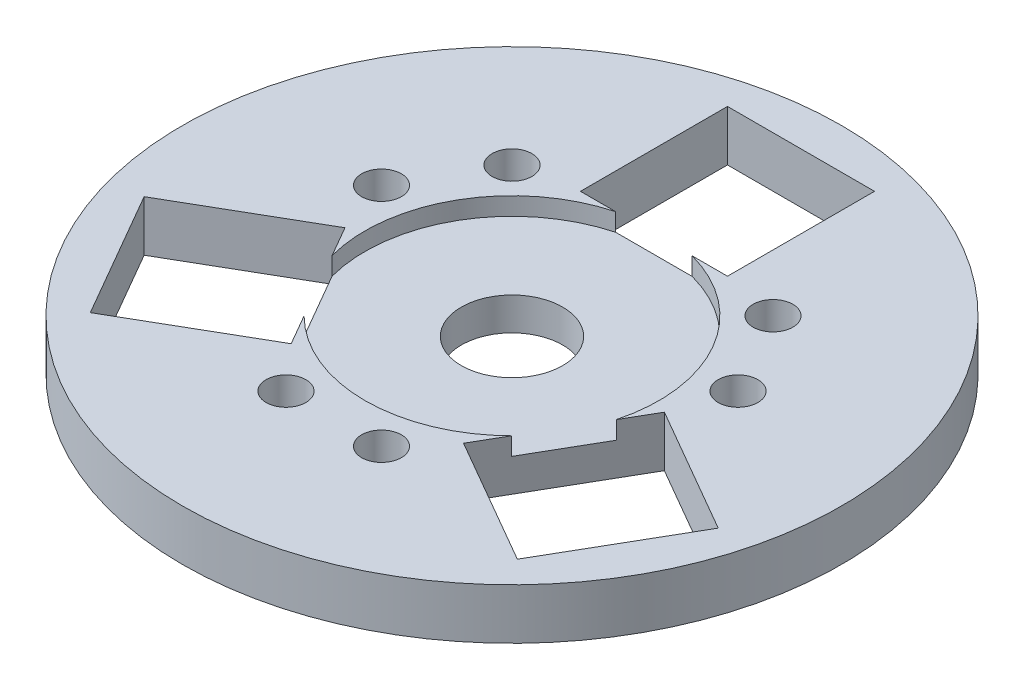
ISO-10303-21;
HEADER;
FILE_DESCRIPTION(('STEP AP214'),'2;1');
FILE_NAME('part.step','',(''),(''),'','','');
FILE_SCHEMA(('AUTOMOTIVE_DESIGN { 1 0 10303 214 1 1 1 1 }'));
ENDSEC;
DATA;
#1=APPLICATION_CONTEXT('core data for automotive mechanical design processes');
#2=APPLICATION_PROTOCOL_DEFINITION('international standard','automotive_design',2000,#1);
#3=PRODUCT_CONTEXT('',#1,'mechanical');
#4=PRODUCT('Part','Part','',(#3));
#5=PRODUCT_RELATED_PRODUCT_CATEGORY('part','',(#4));
#6=PRODUCT_DEFINITION_FORMATION('','',#4);
#7=PRODUCT_DEFINITION_CONTEXT('part definition',#1,'design');
#8=PRODUCT_DEFINITION('design','',#6,#7);
#9=PRODUCT_DEFINITION_SHAPE('','',#8);
#10=(LENGTH_UNIT() NAMED_UNIT(*) SI_UNIT(.MILLI.,.METRE.));
#11=(NAMED_UNIT(*) PLANE_ANGLE_UNIT() SI_UNIT($,.RADIAN.));
#12=(NAMED_UNIT(*) SI_UNIT($,.STERADIAN.) SOLID_ANGLE_UNIT());
#13=UNCERTAINTY_MEASURE_WITH_UNIT(LENGTH_MEASURE(1.E-05),#10,'distance_accuracy_value','');
#14=(GEOMETRIC_REPRESENTATION_CONTEXT(3) GLOBAL_UNCERTAINTY_ASSIGNED_CONTEXT((#13)) GLOBAL_UNIT_ASSIGNED_CONTEXT((#10,
#11,#12)) REPRESENTATION_CONTEXT('',''));
#15=CARTESIAN_POINT('',(0.,0.,0.));
#16=DIRECTION('',(0.,0.,1.));
#17=DIRECTION('',(1.,0.,0.));
#18=AXIS2_PLACEMENT_3D('',#15,#16,#17);
#19=CARTESIAN_POINT('',(0.,3.175,0.));
#20=DIRECTION('',(0.,-1.,0.));
#21=DIRECTION('',(0.,0.,-1.));
#22=AXIS2_PLACEMENT_3D('',#19,#20,#21);
#23=CYLINDRICAL_SURFACE('',#22,6.35);
#24=CARTESIAN_POINT('',(0.,-3.175,0.));
#25=DIRECTION('',(0.,1.,0.));
#26=DIRECTION('',(0.,0.,1.));
#27=AXIS2_PLACEMENT_3D('',#24,#25,#26);
#28=CIRCLE('',#27,6.35);
#29=CARTESIAN_POINT('',(0.,-3.175,6.35));
#30=VERTEX_POINT('',#29);
#31=EDGE_CURVE('E294',#30,#30,#28,.T.);
#32=ORIENTED_EDGE('',*,*,#31,.F.);
#33=EDGE_LOOP('',(#32));
#34=FACE_BOUND('',#33,.T.);
#35=CARTESIAN_POINT('',(0.,0.9398,0.));
#36=DIRECTION('',(0.,1.,0.));
#37=DIRECTION('',(0.,0.,1.));
#38=AXIS2_PLACEMENT_3D('',#35,#36,#37);
#39=CIRCLE('',#38,6.35);
#40=CARTESIAN_POINT('',(0.,0.9398,6.35));
#41=VERTEX_POINT('',#40);
#42=EDGE_CURVE('E185',#41,#41,#39,.T.);
#43=ORIENTED_EDGE('',*,*,#42,.T.);
#44=EDGE_LOOP('',(#43));
#45=FACE_BOUND('',#44,.T.);
#46=ADVANCED_FACE('F38',(#34,#45),#23,.F.);
#47=CARTESIAN_POINT('',(0.,3.175,0.));
#48=DIRECTION('',(0.,1.,0.));
#49=DIRECTION('',(0.,0.,1.));
#50=AXIS2_PLACEMENT_3D('',#47,#48,#49);
#51=PLANE('',#50);
#52=CARTESIAN_POINT('',(22.3264095488456,3.175,-5.98234340849944));
#53=DIRECTION('',(0.,1.,0.));
#54=DIRECTION('',(-0.866025403784436,0.,-0.500000000000004));
#55=AXIS2_PLACEMENT_3D('',#52,#53,#54);
#56=CIRCLE('',#55,2.4892);
#57=CARTESIAN_POINT('',(20.1706991137454,3.175,-7.22694340849945));
#58=VERTEX_POINT('',#57);
#59=EDGE_CURVE('E343',#58,#58,#56,.T.);
#60=ORIENTED_EDGE('',*,*,#59,.F.);
#61=EDGE_LOOP('',(#60));
#62=FACE_BOUND('',#61,.T.);
#63=CARTESIAN_POINT('',(5.98234340849958,3.175,22.3264095488455));
#64=DIRECTION('',(0.,1.,0.));
#65=DIRECTION('',(0.866025403784443,0.,-0.499999999999992));
#66=AXIS2_PLACEMENT_3D('',#63,#64,#65);
#67=CIRCLE('',#66,2.4892);
#68=CARTESIAN_POINT('',(8.13805384359982,3.175,21.0818095488456));
#69=VERTEX_POINT('',#68);
#70=EDGE_CURVE('E354',#69,#69,#67,.T.);
#71=ORIENTED_EDGE('',*,*,#70,.F.);
#72=EDGE_LOOP('',(#71));
#73=FACE_BOUND('',#72,.T.);
#74=CARTESIAN_POINT('',(-5.98234340849999,3.175,22.3264095488454));
#75=DIRECTION('',(0.,1.,0.));
#76=DIRECTION('',(0.866025403784443,0.,-0.499999999999992));
#77=AXIS2_PLACEMENT_3D('',#74,#75,#76);
#78=CIRCLE('',#77,2.4892);
#79=CARTESIAN_POINT('',(-3.82663297339976,3.175,21.0818095488455));
#80=VERTEX_POINT('',#79);
#81=EDGE_CURVE('E333',#80,#80,#78,.T.);
#82=ORIENTED_EDGE('',*,*,#81,.F.);
#83=EDGE_LOOP('',(#82));
#84=FACE_BOUND('',#83,.T.);
#85=CARTESIAN_POINT('',(16.3440661403458,3.175,-16.3440661403459));
#86=DIRECTION('',(0.,1.,0.));
#87=DIRECTION('',(-0.866025403784436,0.,-0.500000000000004));
#88=AXIS2_PLACEMENT_3D('',#85,#86,#87);
#89=CIRCLE('',#88,2.4892);
#90=CARTESIAN_POINT('',(14.1883557052456,3.175,-17.5886661403459));
#91=VERTEX_POINT('',#90);
#92=EDGE_CURVE('E359',#91,#91,#89,.T.);
#93=ORIENTED_EDGE('',*,*,#92,.F.);
#94=EDGE_LOOP('',(#93));
#95=FACE_BOUND('',#94,.T.);
#96=CARTESIAN_POINT('',(-16.3440661403458,3.175,-16.3440661403459));
#97=DIRECTION('',(0.,1.,0.));
#98=DIRECTION('',(0.,0.,1.));
#99=AXIS2_PLACEMENT_3D('',#96,#97,#98);
#100=CIRCLE('',#99,2.4892);
#101=CARTESIAN_POINT('',(-16.3440661403458,3.175,-13.8548661403459));
#102=VERTEX_POINT('',#101);
#103=EDGE_CURVE('E325',#102,#102,#100,.T.);
#104=ORIENTED_EDGE('',*,*,#103,.F.);
#105=EDGE_LOOP('',(#104));
#106=FACE_BOUND('',#105,.T.);
#107=CARTESIAN_POINT('',(-22.3264095488456,3.175,-5.98234340849954));
#108=DIRECTION('',(0.,1.,0.));
#109=DIRECTION('',(0.,0.,1.));
#110=AXIS2_PLACEMENT_3D('',#107,#108,#109);
#111=CIRCLE('',#110,2.4892);
#112=CARTESIAN_POINT('',(-22.3264095488456,3.175,-3.49314340849954));
#113=VERTEX_POINT('',#112);
#114=EDGE_CURVE('E337',#113,#113,#111,.T.);
#115=ORIENTED_EDGE('',*,*,#114,.F.);
#116=EDGE_LOOP('',(#115));
#117=FACE_BOUND('',#116,.T.);
#118=CARTESIAN_POINT('',(0.,3.175,0.));
#119=DIRECTION('',(0.,1.,0.));
#120=DIRECTION('',(0.,0.,1.));
#121=AXIS2_PLACEMENT_3D('',#118,#119,#120);
#122=CIRCLE('',#121,18.415);
#123=CARTESIAN_POINT('',(17.7950041124858,3.175,4.7381487562776));
#124=VERTEX_POINT('',#123);
#125=CARTESIAN_POINT('',(4.79414486639694,3.175,-17.78));
#126=VERTEX_POINT('',#125);
#127=EDGE_CURVE('E177',#124,#126,#122,.T.);
#128=ORIENTED_EDGE('',*,*,#127,.F.);
#129=DIRECTION('',(-0.500000000000004,0.,0.866025403784436));
#130=VECTOR('',#129,1.);
#131=CARTESIAN_POINT('',(20.0016816792873,3.175,0.916071094654875));
#132=LINE('',#131,#130);
#133=CARTESIAN_POINT('',(20.0016816792873,3.175,0.916071094654875));
#134=VERTEX_POINT('',#133);
#135=EDGE_CURVE('E222',#134,#124,#132,.T.);
#136=ORIENTED_EDGE('',*,*,#135,.F.);
#137=DIRECTION('',(-0.866025403784436,0.,-0.500000000000004));
#138=VECTOR('',#137,1.);
#139=CARTESIAN_POINT('',(35.9495394899777,3.175,10.1235710946549));
#140=LINE('',#139,#138);
#141=CARTESIAN_POINT('',(35.9495394899777,3.175,10.1235710946549));
#142=VERTEX_POINT('',#141);
#143=EDGE_CURVE('E61',#142,#134,#140,.T.);
#144=ORIENTED_EDGE('',*,*,#143,.F.);
#145=DIRECTION('',(0.500000000000004,0.,-0.866025403784436));
#146=VECTOR('',#145,1.);
#147=CARTESIAN_POINT('',(35.9495394899777,3.175,10.1235710946549));
#148=LINE('',#147,#146);
#149=CARTESIAN_POINT('',(26.7420394899776,3.175,26.0714289053453));
#150=VERTEX_POINT('',#149);
#151=EDGE_CURVE('E209',#150,#142,#148,.T.);
#152=ORIENTED_EDGE('',*,*,#151,.F.);
#153=DIRECTION('',(0.866025403784436,0.,0.500000000000004));
#154=VECTOR('',#153,1.);
#155=CARTESIAN_POINT('',(26.7420394899776,3.175,26.0714289053453));
#156=LINE('',#155,#154);
#157=CARTESIAN_POINT('',(10.7941816792872,3.175,16.8639289053453));
#158=VERTEX_POINT('',#157);
#159=EDGE_CURVE('E225',#158,#150,#156,.T.);
#160=ORIENTED_EDGE('',*,*,#159,.F.);
#161=CARTESIAN_POINT('',(13.0008592460888,3.175,13.0418512437225));
#162=VERTEX_POINT('',#161);
#163=EDGE_CURVE('E220',#162,#158,#132,.T.);
#164=ORIENTED_EDGE('',*,*,#163,.F.);
#165=CARTESIAN_POINT('',(-13.000859246089,3.175,13.0418512437224));
#166=VERTEX_POINT('',#165);
#167=EDGE_CURVE('E321',#166,#162,#122,.T.);
#168=ORIENTED_EDGE('',*,*,#167,.F.);
#169=DIRECTION('',(-0.499999999999992,0.,-0.866025403784443));
#170=VECTOR('',#169,1.);
#171=CARTESIAN_POINT('',(-10.7941816792875,3.175,16.8639289053451));
#172=LINE('',#171,#170);
#173=CARTESIAN_POINT('',(-10.7941816792875,3.175,16.8639289053451));
#174=VERTEX_POINT('',#173);
#175=EDGE_CURVE('E183',#174,#166,#172,.T.);
#176=ORIENTED_EDGE('',*,*,#175,.F.);
#177=DIRECTION('',(0.866025403784443,0.,-0.499999999999992));
#178=VECTOR('',#177,1.);
#179=CARTESIAN_POINT('',(-26.742039489978,3.175,26.071428905345));
#180=LINE('',#179,#178);
#181=CARTESIAN_POINT('',(-26.742039489978,3.175,26.071428905345));
#182=VERTEX_POINT('',#181);
#183=EDGE_CURVE('E202',#182,#174,#180,.T.);
#184=ORIENTED_EDGE('',*,*,#183,.F.);
#185=DIRECTION('',(0.499999999999992,0.,0.866025403784443));
#186=VECTOR('',#185,1.);
#187=CARTESIAN_POINT('',(-26.742039489978,3.175,26.071428905345));
#188=LINE('',#187,#186);
#189=CARTESIAN_POINT('',(-35.9495394899778,3.175,10.1235710946544));
#190=VERTEX_POINT('',#189);
#191=EDGE_CURVE('E243',#190,#182,#188,.T.);
#192=ORIENTED_EDGE('',*,*,#191,.F.);
#193=DIRECTION('',(-0.866025403784443,0.,0.499999999999992));
#194=VECTOR('',#193,1.);
#195=CARTESIAN_POINT('',(-35.9495394899778,3.175,10.1235710946544));
#196=LINE('',#195,#194);
#197=CARTESIAN_POINT('',(-20.0016816792873,3.175,0.916071094654596));
#198=VERTEX_POINT('',#197);
#199=EDGE_CURVE('E256',#198,#190,#196,.T.);
#200=ORIENTED_EDGE('',*,*,#199,.F.);
#201=CARTESIAN_POINT('',(-17.7950041124858,3.175,4.73814875627733));
#202=VERTEX_POINT('',#201);
#203=EDGE_CURVE('E254',#202,#198,#172,.T.);
#204=ORIENTED_EDGE('',*,*,#203,.F.);
#205=CARTESIAN_POINT('',(-4.79414486639694,3.175,-17.78));
#206=VERTEX_POINT('',#205);
#207=EDGE_CURVE('E319',#206,#202,#122,.T.);
#208=ORIENTED_EDGE('',*,*,#207,.F.);
#209=DIRECTION('',(1.,0.,0.));
#210=VECTOR('',#209,1.);
#211=CARTESIAN_POINT('',(-9.2075,3.175,-17.78));
#212=LINE('',#211,#210);
#213=CARTESIAN_POINT('',(-9.2075,3.175,-17.78));
#214=VERTEX_POINT('',#213);
#215=EDGE_CURVE('E284',#214,#206,#212,.T.);
#216=ORIENTED_EDGE('',*,*,#215,.F.);
#217=DIRECTION('',(0.,0.,1.));
#218=VECTOR('',#217,1.);
#219=CARTESIAN_POINT('',(-9.2075,3.175,-36.195));
#220=LINE('',#219,#218);
#221=CARTESIAN_POINT('',(-9.2075,3.175,-36.195));
#222=VERTEX_POINT('',#221);
#223=EDGE_CURVE('E232',#222,#214,#220,.T.);
#224=ORIENTED_EDGE('',*,*,#223,.F.);
#225=DIRECTION('',(-1.,0.,0.));
#226=VECTOR('',#225,1.);
#227=CARTESIAN_POINT('',(-9.2075,3.175,-36.195));
#228=LINE('',#227,#226);
#229=CARTESIAN_POINT('',(9.2075,3.175,-36.195));
#230=VERTEX_POINT('',#229);
#231=EDGE_CURVE('E272',#230,#222,#228,.T.);
#232=ORIENTED_EDGE('',*,*,#231,.F.);
#233=DIRECTION('',(0.,0.,-1.));
#234=VECTOR('',#233,1.);
#235=CARTESIAN_POINT('',(9.2075,3.175,-36.195));
#236=LINE('',#235,#234);
#237=CARTESIAN_POINT('',(9.2075,3.175,-17.78));
#238=VERTEX_POINT('',#237);
#239=EDGE_CURVE('E287',#238,#230,#236,.T.);
#240=ORIENTED_EDGE('',*,*,#239,.F.);
#241=EDGE_CURVE('E283',#126,#238,#212,.T.);
#242=ORIENTED_EDGE('',*,*,#241,.F.);
#243=EDGE_LOOP('',(#128,#136,#144,#152,#160,#164,#168,#176,#184,#192,#200,#204,#208,#216,#224,
#232,#240,#242));
#244=FACE_BOUND('',#243,.T.);
#245=CARTESIAN_POINT('',(0.,3.175,0.));
#246=DIRECTION('',(0.,1.,0.));
#247=DIRECTION('',(0.,0.,1.));
#248=AXIS2_PLACEMENT_3D('',#245,#246,#247);
#249=CIRCLE('',#248,41.275);
#250=CARTESIAN_POINT('',(0.,3.175,41.275));
#251=VERTEX_POINT('',#250);
#252=EDGE_CURVE('E198',#251,#251,#249,.T.);
#253=ORIENTED_EDGE('',*,*,#252,.T.);
#254=EDGE_LOOP('',(#253));
#255=FACE_BOUND('',#254,.T.);
#256=ADVANCED_FACE('F316',(#62,#73,#84,#95,#106,#117,#244,#255),#51,.T.);
#257=CARTESIAN_POINT('',(0.,-3.175,0.));
#258=DIRECTION('',(0.,1.,0.));
#259=DIRECTION('',(0.,0.,1.));
#260=AXIS2_PLACEMENT_3D('',#257,#258,#259);
#261=PLANE('',#260);
#262=CARTESIAN_POINT('',(22.3264095488456,-3.175,-5.98234340849944));
#263=DIRECTION('',(0.,1.,0.));
#264=DIRECTION('',(-0.866025403784436,0.,-0.500000000000004));
#265=AXIS2_PLACEMENT_3D('',#262,#263,#264);
#266=CIRCLE('',#265,2.4892);
#267=CARTESIAN_POINT('',(20.1706991137454,-3.175,-7.22694340849945));
#268=VERTEX_POINT('',#267);
#269=EDGE_CURVE('E339',#268,#268,#266,.T.);
#270=ORIENTED_EDGE('',*,*,#269,.T.);
#271=EDGE_LOOP('',(#270));
#272=FACE_BOUND('',#271,.T.);
#273=CARTESIAN_POINT('',(5.98234340849958,-3.175,22.3264095488455));
#274=DIRECTION('',(0.,1.,0.));
#275=DIRECTION('',(0.866025403784443,0.,-0.499999999999992));
#276=AXIS2_PLACEMENT_3D('',#273,#274,#275);
#277=CIRCLE('',#276,2.4892);
#278=CARTESIAN_POINT('',(8.13805384359982,-3.175,21.0818095488456));
#279=VERTEX_POINT('',#278);
#280=EDGE_CURVE('E351',#279,#279,#277,.T.);
#281=ORIENTED_EDGE('',*,*,#280,.T.);
#282=EDGE_LOOP('',(#281));
#283=FACE_BOUND('',#282,.T.);
#284=CARTESIAN_POINT('',(-5.98234340849999,-3.175,22.3264095488454));
#285=DIRECTION('',(0.,1.,0.));
#286=DIRECTION('',(0.866025403784443,0.,-0.499999999999992));
#287=AXIS2_PLACEMENT_3D('',#284,#285,#286);
#288=CIRCLE('',#287,2.4892);
#289=CARTESIAN_POINT('',(-3.82663297339976,-3.175,21.0818095488455));
#290=VERTEX_POINT('',#289);
#291=EDGE_CURVE('E361',#290,#290,#288,.T.);
#292=ORIENTED_EDGE('',*,*,#291,.T.);
#293=EDGE_LOOP('',(#292));
#294=FACE_BOUND('',#293,.T.);
#295=CARTESIAN_POINT('',(16.3440661403458,-3.175,-16.3440661403459));
#296=DIRECTION('',(0.,1.,0.));
#297=DIRECTION('',(-0.866025403784436,0.,-0.500000000000004));
#298=AXIS2_PLACEMENT_3D('',#295,#296,#297);
#299=CIRCLE('',#298,2.4892);
#300=CARTESIAN_POINT('',(14.1883557052456,-3.175,-17.5886661403459));
#301=VERTEX_POINT('',#300);
#302=EDGE_CURVE('E348',#301,#301,#299,.T.);
#303=ORIENTED_EDGE('',*,*,#302,.T.);
#304=EDGE_LOOP('',(#303));
#305=FACE_BOUND('',#304,.T.);
#306=CARTESIAN_POINT('',(-16.3440661403458,-3.175,-16.3440661403459));
#307=DIRECTION('',(0.,1.,0.));
#308=DIRECTION('',(0.,0.,1.));
#309=AXIS2_PLACEMENT_3D('',#306,#307,#308);
#310=CIRCLE('',#309,2.4892);
#311=CARTESIAN_POINT('',(-16.3440661403458,-3.175,-13.8548661403459));
#312=VERTEX_POINT('',#311);
#313=EDGE_CURVE('E323',#312,#312,#310,.T.);
#314=ORIENTED_EDGE('',*,*,#313,.T.);
#315=EDGE_LOOP('',(#314));
#316=FACE_BOUND('',#315,.T.);
#317=CARTESIAN_POINT('',(-22.3264095488456,-3.175,-5.98234340849954));
#318=DIRECTION('',(0.,1.,0.));
#319=DIRECTION('',(0.,0.,1.));
#320=AXIS2_PLACEMENT_3D('',#317,#318,#319);
#321=CIRCLE('',#320,2.4892);
#322=CARTESIAN_POINT('',(-22.3264095488456,-3.175,-3.49314340849954));
#323=VERTEX_POINT('',#322);
#324=EDGE_CURVE('E330',#323,#323,#321,.T.);
#325=ORIENTED_EDGE('',*,*,#324,.T.);
#326=EDGE_LOOP('',(#325));
#327=FACE_BOUND('',#326,.T.);
#328=ORIENTED_EDGE('',*,*,#31,.T.);
#329=EDGE_LOOP('',(#328));
#330=FACE_BOUND('',#329,.T.);
#331=DIRECTION('',(-1.,0.,0.));
#332=VECTOR('',#331,1.);
#333=CARTESIAN_POINT('',(-9.2075,-3.175,-36.195));
#334=LINE('',#333,#332);
#335=CARTESIAN_POINT('',(9.2075,-3.175,-36.195));
#336=VERTEX_POINT('',#335);
#337=CARTESIAN_POINT('',(-9.2075,-3.175,-36.195));
#338=VERTEX_POINT('',#337);
#339=EDGE_CURVE('E278',#336,#338,#334,.T.);
#340=ORIENTED_EDGE('',*,*,#339,.T.);
#341=DIRECTION('',(0.,0.,1.));
#342=VECTOR('',#341,1.);
#343=CARTESIAN_POINT('',(-9.2075,-3.175,-36.195));
#344=LINE('',#343,#342);
#345=CARTESIAN_POINT('',(-9.2075,-3.175,-17.78));
#346=VERTEX_POINT('',#345);
#347=EDGE_CURVE('E268',#338,#346,#344,.T.);
#348=ORIENTED_EDGE('',*,*,#347,.T.);
#349=DIRECTION('',(1.,0.,0.));
#350=VECTOR('',#349,1.);
#351=CARTESIAN_POINT('',(-9.2075,-3.175,-17.78));
#352=LINE('',#351,#350);
#353=CARTESIAN_POINT('',(9.2075,-3.175,-17.78));
#354=VERTEX_POINT('',#353);
#355=EDGE_CURVE('E271',#346,#354,#352,.T.);
#356=ORIENTED_EDGE('',*,*,#355,.T.);
#357=DIRECTION('',(0.,0.,-1.));
#358=VECTOR('',#357,1.);
#359=CARTESIAN_POINT('',(9.2075,-3.175,-36.195));
#360=LINE('',#359,#358);
#361=EDGE_CURVE('E275',#354,#336,#360,.T.);
#362=ORIENTED_EDGE('',*,*,#361,.T.);
#363=EDGE_LOOP('',(#340,#348,#356,#362));
#364=FACE_BOUND('',#363,.T.);
#365=DIRECTION('',(0.499999999999992,0.,0.866025403784443));
#366=VECTOR('',#365,1.);
#367=CARTESIAN_POINT('',(-26.742039489978,-3.175,26.071428905345));
#368=LINE('',#367,#366);
#369=CARTESIAN_POINT('',(-35.9495394899778,-3.175,10.1235710946544));
#370=VERTEX_POINT('',#369);
#371=CARTESIAN_POINT('',(-26.742039489978,-3.175,26.071428905345));
#372=VERTEX_POINT('',#371);
#373=EDGE_CURVE('E249',#370,#372,#368,.T.);
#374=ORIENTED_EDGE('',*,*,#373,.T.);
#375=DIRECTION('',(0.866025403784443,0.,-0.499999999999992));
#376=VECTOR('',#375,1.);
#377=CARTESIAN_POINT('',(-26.742039489978,-3.175,26.071428905345));
#378=LINE('',#377,#376);
#379=CARTESIAN_POINT('',(-10.7941816792875,-3.175,16.8639289053451));
#380=VERTEX_POINT('',#379);
#381=EDGE_CURVE('E239',#372,#380,#378,.T.);
#382=ORIENTED_EDGE('',*,*,#381,.T.);
#383=DIRECTION('',(-0.499999999999992,0.,-0.866025403784443));
#384=VECTOR('',#383,1.);
#385=CARTESIAN_POINT('',(-10.7941816792875,-3.175,16.8639289053451));
#386=LINE('',#385,#384);
#387=CARTESIAN_POINT('',(-20.0016816792873,-3.175,0.916071094654596));
#388=VERTEX_POINT('',#387);
#389=EDGE_CURVE('E242',#380,#388,#386,.T.);
#390=ORIENTED_EDGE('',*,*,#389,.T.);
#391=DIRECTION('',(-0.866025403784443,0.,0.499999999999992));
#392=VECTOR('',#391,1.);
#393=CARTESIAN_POINT('',(-35.9495394899778,-3.175,10.1235710946544));
#394=LINE('',#393,#392);
#395=EDGE_CURVE('E246',#388,#370,#394,.T.);
#396=ORIENTED_EDGE('',*,*,#395,.T.);
#397=EDGE_LOOP('',(#374,#382,#390,#396));
#398=FACE_BOUND('',#397,.T.);
#399=DIRECTION('',(0.500000000000004,0.,-0.866025403784436));
#400=VECTOR('',#399,1.);
#401=CARTESIAN_POINT('',(35.9495394899777,-3.175,10.1235710946549));
#402=LINE('',#401,#400);
#403=CARTESIAN_POINT('',(26.7420394899776,-3.175,26.0714289053453));
#404=VERTEX_POINT('',#403);
#405=CARTESIAN_POINT('',(35.9495394899777,-3.175,10.1235710946549));
#406=VERTEX_POINT('',#405);
#407=EDGE_CURVE('E215',#404,#406,#402,.T.);
#408=ORIENTED_EDGE('',*,*,#407,.T.);
#409=DIRECTION('',(-0.866025403784436,0.,-0.500000000000004));
#410=VECTOR('',#409,1.);
#411=CARTESIAN_POINT('',(35.9495394899777,-3.175,10.1235710946549));
#412=LINE('',#411,#410);
#413=CARTESIAN_POINT('',(20.0016816792873,-3.175,0.916071094654875));
#414=VERTEX_POINT('',#413);
#415=EDGE_CURVE('E205',#406,#414,#412,.T.);
#416=ORIENTED_EDGE('',*,*,#415,.T.);
#417=DIRECTION('',(-0.500000000000004,0.,0.866025403784436));
#418=VECTOR('',#417,1.);
#419=CARTESIAN_POINT('',(20.0016816792873,-3.175,0.916071094654875));
#420=LINE('',#419,#418);
#421=CARTESIAN_POINT('',(10.7941816792872,-3.175,16.8639289053453));
#422=VERTEX_POINT('',#421);
#423=EDGE_CURVE('E208',#414,#422,#420,.T.);
#424=ORIENTED_EDGE('',*,*,#423,.T.);
#425=DIRECTION('',(0.866025403784436,0.,0.500000000000004));
#426=VECTOR('',#425,1.);
#427=CARTESIAN_POINT('',(26.7420394899776,-3.175,26.0714289053453));
#428=LINE('',#427,#426);
#429=EDGE_CURVE('E212',#422,#404,#428,.T.);
#430=ORIENTED_EDGE('',*,*,#429,.T.);
#431=EDGE_LOOP('',(#408,#416,#424,#430));
#432=FACE_BOUND('',#431,.T.);
#433=CARTESIAN_POINT('',(0.,-3.175,0.));
#434=DIRECTION('',(0.,1.,0.));
#435=DIRECTION('',(0.,0.,1.));
#436=AXIS2_PLACEMENT_3D('',#433,#434,#435);
#437=CIRCLE('',#436,41.275);
#438=CARTESIAN_POINT('',(0.,-3.175,41.275));
#439=VERTEX_POINT('',#438);
#440=EDGE_CURVE('E199',#439,#439,#437,.T.);
#441=ORIENTED_EDGE('',*,*,#440,.F.);
#442=EDGE_LOOP('',(#441));
#443=FACE_BOUND('',#442,.T.);
#444=ADVANCED_FACE('F40',(#272,#283,#294,#305,#316,#327,#330,#364,#398,#432,#443),#261,.F.);
#445=CARTESIAN_POINT('',(-9.2075,-3.175,-36.195));
#446=DIRECTION('',(-1.,0.,0.));
#447=DIRECTION('',(0.,0.,1.));
#448=AXIS2_PLACEMENT_3D('',#445,#446,#447);
#449=PLANE('',#448);
#450=ORIENTED_EDGE('',*,*,#223,.T.);
#451=DIRECTION('',(0.,1.,0.));
#452=VECTOR('',#451,1.);
#453=CARTESIAN_POINT('',(-9.2075,-3.175,-17.78));
#454=LINE('',#453,#452);
#455=EDGE_CURVE('E281',#346,#214,#454,.T.);
#456=ORIENTED_EDGE('',*,*,#455,.F.);
#457=ORIENTED_EDGE('',*,*,#347,.F.);
#458=DIRECTION('',(0.,1.,0.));
#459=VECTOR('',#458,1.);
#460=CARTESIAN_POINT('',(-9.2075,-3.175,-36.195));
#461=LINE('',#460,#459);
#462=EDGE_CURVE('E292',#338,#222,#461,.T.);
#463=ORIENTED_EDGE('',*,*,#462,.T.);
#464=EDGE_LOOP('',(#450,#456,#457,#463));
#465=FACE_BOUND('',#464,.T.);
#466=ADVANCED_FACE('F401',(#465),#449,.F.);
#467=CARTESIAN_POINT('',(-9.2075,-3.175,-36.195));
#468=DIRECTION('',(0.,0.,-1.));
#469=DIRECTION('',(-1.,0.,0.));
#470=AXIS2_PLACEMENT_3D('',#467,#468,#469);
#471=PLANE('',#470);
#472=ORIENTED_EDGE('',*,*,#231,.T.);
#473=ORIENTED_EDGE('',*,*,#462,.F.);
#474=ORIENTED_EDGE('',*,*,#339,.F.);
#475=DIRECTION('',(0.,1.,0.));
#476=VECTOR('',#475,1.);
#477=CARTESIAN_POINT('',(9.2075,-3.175,-36.195));
#478=LINE('',#477,#476);
#479=EDGE_CURVE('E295',#336,#230,#478,.T.);
#480=ORIENTED_EDGE('',*,*,#479,.T.);
#481=EDGE_LOOP('',(#472,#473,#474,#480));
#482=FACE_BOUND('',#481,.T.);
#483=ADVANCED_FACE('F404',(#482),#471,.F.);
#484=CARTESIAN_POINT('',(9.2075,-3.175,-36.195));
#485=DIRECTION('',(1.,0.,0.));
#486=DIRECTION('',(0.,0.,-1.));
#487=AXIS2_PLACEMENT_3D('',#484,#485,#486);
#488=PLANE('',#487);
#489=ORIENTED_EDGE('',*,*,#239,.T.);
#490=ORIENTED_EDGE('',*,*,#479,.F.);
#491=ORIENTED_EDGE('',*,*,#361,.F.);
#492=DIRECTION('',(0.,1.,0.));
#493=VECTOR('',#492,1.);
#494=CARTESIAN_POINT('',(9.2075,-3.175,-17.78));
#495=LINE('',#494,#493);
#496=EDGE_CURVE('E297',#354,#238,#495,.T.);
#497=ORIENTED_EDGE('',*,*,#496,.T.);
#498=EDGE_LOOP('',(#489,#490,#491,#497));
#499=FACE_BOUND('',#498,.T.);
#500=ADVANCED_FACE('F410',(#499),#488,.F.);
#501=CARTESIAN_POINT('',(-9.2075,-3.175,-17.78));
#502=DIRECTION('',(0.,0.,1.));
#503=DIRECTION('',(1.,0.,0.));
#504=AXIS2_PLACEMENT_3D('',#501,#502,#503);
#505=PLANE('',#504);
#506=DIRECTION('',(-1.,0.,0.));
#507=VECTOR('',#506,1.);
#508=CARTESIAN_POINT('',(-9.2075,0.9398,-17.78));
#509=LINE('',#508,#507);
#510=CARTESIAN_POINT('',(4.79414486639694,0.939799999999998,-17.78));
#511=VERTEX_POINT('',#510);
#512=CARTESIAN_POINT('',(-4.79414486639694,0.939799999999998,-17.78));
#513=VERTEX_POINT('',#512);
#514=EDGE_CURVE('E169',#511,#513,#509,.T.);
#515=ORIENTED_EDGE('',*,*,#514,.F.);
#516=DIRECTION('',(0.,1.,0.));
#517=VECTOR('',#516,1.);
#518=CARTESIAN_POINT('',(4.79414486639694,-55.2604855022011,-17.78));
#519=LINE('',#518,#517);
#520=EDGE_CURVE('E195',#511,#126,#519,.T.);
#521=ORIENTED_EDGE('',*,*,#520,.T.);
#522=ORIENTED_EDGE('',*,*,#241,.T.);
#523=ORIENTED_EDGE('',*,*,#496,.F.);
#524=ORIENTED_EDGE('',*,*,#355,.F.);
#525=ORIENTED_EDGE('',*,*,#455,.T.);
#526=ORIENTED_EDGE('',*,*,#215,.T.);
#527=DIRECTION('',(0.,1.,0.));
#528=VECTOR('',#527,1.);
#529=CARTESIAN_POINT('',(-4.79414486639694,-55.2604855022011,-17.78));
#530=LINE('',#529,#528);
#531=EDGE_CURVE('E187',#206,#513,#530,.F.);
#532=ORIENTED_EDGE('',*,*,#531,.T.);
#533=EDGE_LOOP('',(#515,#521,#522,#523,#524,#525,#526,#532));
#534=FACE_BOUND('',#533,.T.);
#535=ADVANCED_FACE('F406',(#534),#505,.F.);
#536=CARTESIAN_POINT('',(-26.742039489978,-3.175,26.071428905345));
#537=DIRECTION('',(0.499999999999992,0.,0.866025403784443));
#538=DIRECTION('',(0.866025403784443,0.,-0.499999999999992));
#539=AXIS2_PLACEMENT_3D('',#536,#537,#538);
#540=PLANE('',#539);
#541=ORIENTED_EDGE('',*,*,#183,.T.);
#542=DIRECTION('',(0.,1.,0.));
#543=VECTOR('',#542,1.);
#544=CARTESIAN_POINT('',(-10.7941816792875,-3.175,16.8639289053451));
#545=LINE('',#544,#543);
#546=EDGE_CURVE('E252',#380,#174,#545,.T.);
#547=ORIENTED_EDGE('',*,*,#546,.F.);
#548=ORIENTED_EDGE('',*,*,#381,.F.);
#549=DIRECTION('',(0.,1.,0.));
#550=VECTOR('',#549,1.);
#551=CARTESIAN_POINT('',(-26.742039489978,-3.175,26.071428905345));
#552=LINE('',#551,#550);
#553=EDGE_CURVE('E221',#372,#182,#552,.T.);
#554=ORIENTED_EDGE('',*,*,#553,.T.);
#555=EDGE_LOOP('',(#541,#547,#548,#554));
#556=FACE_BOUND('',#555,.T.);
#557=ADVANCED_FACE('F409',(#556),#540,.F.);
#558=CARTESIAN_POINT('',(-26.742039489978,-3.175,26.071428905345));
#559=DIRECTION('',(-0.866025403784443,0.,0.499999999999992));
#560=DIRECTION('',(0.499999999999992,0.,0.866025403784443));
#561=AXIS2_PLACEMENT_3D('',#558,#559,#560);
#562=PLANE('',#561);
#563=ORIENTED_EDGE('',*,*,#191,.T.);
#564=ORIENTED_EDGE('',*,*,#553,.F.);
#565=ORIENTED_EDGE('',*,*,#373,.F.);
#566=DIRECTION('',(0.,1.,0.));
#567=VECTOR('',#566,1.);
#568=CARTESIAN_POINT('',(-35.9495394899778,-3.175,10.1235710946544));
#569=LINE('',#568,#567);
#570=EDGE_CURVE('E262',#370,#190,#569,.T.);
#571=ORIENTED_EDGE('',*,*,#570,.T.);
#572=EDGE_LOOP('',(#563,#564,#565,#571));
#573=FACE_BOUND('',#572,.T.);
#574=ADVANCED_FACE('F420',(#573),#562,.F.);
#575=CARTESIAN_POINT('',(-35.9495394899778,-3.175,10.1235710946544));
#576=DIRECTION('',(-0.499999999999992,0.,-0.866025403784443));
#577=DIRECTION('',(-0.866025403784443,0.,0.499999999999992));
#578=AXIS2_PLACEMENT_3D('',#575,#576,#577);
#579=PLANE('',#578);
#580=ORIENTED_EDGE('',*,*,#199,.T.);
#581=ORIENTED_EDGE('',*,*,#570,.F.);
#582=ORIENTED_EDGE('',*,*,#395,.F.);
#583=DIRECTION('',(0.,1.,0.));
#584=VECTOR('',#583,1.);
#585=CARTESIAN_POINT('',(-20.0016816792873,-3.175,0.916071094654596));
#586=LINE('',#585,#584);
#587=EDGE_CURVE('E264',#388,#198,#586,.T.);
#588=ORIENTED_EDGE('',*,*,#587,.T.);
#589=EDGE_LOOP('',(#580,#581,#582,#588));
#590=FACE_BOUND('',#589,.T.);
#591=ADVANCED_FACE('F425',(#590),#579,.F.);
#592=CARTESIAN_POINT('',(-10.7941816792875,-3.175,16.8639289053451));
#593=DIRECTION('',(0.866025403784443,0.,-0.499999999999992));
#594=DIRECTION('',(-0.499999999999992,0.,-0.866025403784443));
#595=AXIS2_PLACEMENT_3D('',#592,#593,#594);
#596=PLANE('',#595);
#597=DIRECTION('',(0.499999999999992,0.,0.866025403784443));
#598=VECTOR('',#597,1.);
#599=CARTESIAN_POINT('',(-10.7941816792875,0.9398,16.8639289053451));
#600=LINE('',#599,#598);
#601=CARTESIAN_POINT('',(-17.7950041124858,0.939799999999998,4.73814875627733));
#602=VERTEX_POINT('',#601);
#603=CARTESIAN_POINT('',(-13.000859246089,0.939799999999998,13.0418512437224));
#604=VERTEX_POINT('',#603);
#605=EDGE_CURVE('E162',#602,#604,#600,.T.);
#606=ORIENTED_EDGE('',*,*,#605,.F.);
#607=DIRECTION('',(0.,1.,0.));
#608=VECTOR('',#607,1.);
#609=CARTESIAN_POINT('',(-17.7950041124858,-55.2604855022011,4.73814875627733));
#610=LINE('',#609,#608);
#611=EDGE_CURVE('E184',#602,#202,#610,.T.);
#612=ORIENTED_EDGE('',*,*,#611,.T.);
#613=ORIENTED_EDGE('',*,*,#203,.T.);
#614=ORIENTED_EDGE('',*,*,#587,.F.);
#615=ORIENTED_EDGE('',*,*,#389,.F.);
#616=ORIENTED_EDGE('',*,*,#546,.T.);
#617=ORIENTED_EDGE('',*,*,#175,.T.);
#618=DIRECTION('',(0.,1.,0.));
#619=VECTOR('',#618,1.);
#620=CARTESIAN_POINT('',(-13.000859246089,-55.2604855022011,13.0418512437224));
#621=LINE('',#620,#619);
#622=EDGE_CURVE('E173',#166,#604,#621,.F.);
#623=ORIENTED_EDGE('',*,*,#622,.T.);
#624=EDGE_LOOP('',(#606,#612,#613,#614,#615,#616,#617,#623));
#625=FACE_BOUND('',#624,.T.);
#626=ADVANCED_FACE('F180',(#625),#596,.F.);
#627=CARTESIAN_POINT('',(35.9495394899777,-3.175,10.1235710946549));
#628=DIRECTION('',(0.500000000000004,0.,-0.866025403784436));
#629=DIRECTION('',(-0.866025403784436,0.,-0.500000000000004));
#630=AXIS2_PLACEMENT_3D('',#627,#628,#629);
#631=PLANE('',#630);
#632=ORIENTED_EDGE('',*,*,#143,.T.);
#633=DIRECTION('',(0.,1.,0.));
#634=VECTOR('',#633,1.);
#635=CARTESIAN_POINT('',(20.0016816792873,-3.175,0.916071094654875));
#636=LINE('',#635,#634);
#637=EDGE_CURVE('E218',#414,#134,#636,.T.);
#638=ORIENTED_EDGE('',*,*,#637,.F.);
#639=ORIENTED_EDGE('',*,*,#415,.F.);
#640=DIRECTION('',(0.,1.,0.));
#641=VECTOR('',#640,1.);
#642=CARTESIAN_POINT('',(35.9495394899777,-3.175,10.1235710946549));
#643=LINE('',#642,#641);
#644=EDGE_CURVE('E230',#406,#142,#643,.T.);
#645=ORIENTED_EDGE('',*,*,#644,.T.);
#646=EDGE_LOOP('',(#632,#638,#639,#645));
#647=FACE_BOUND('',#646,.T.);
#648=ADVANCED_FACE('F424',(#647),#631,.F.);
#649=CARTESIAN_POINT('',(35.9495394899777,-3.175,10.1235710946549));
#650=DIRECTION('',(0.866025403784436,0.,0.500000000000004));
#651=DIRECTION('',(0.500000000000004,0.,-0.866025403784436));
#652=AXIS2_PLACEMENT_3D('',#649,#650,#651);
#653=PLANE('',#652);
#654=ORIENTED_EDGE('',*,*,#151,.T.);
#655=ORIENTED_EDGE('',*,*,#644,.F.);
#656=ORIENTED_EDGE('',*,*,#407,.F.);
#657=DIRECTION('',(0.,1.,0.));
#658=VECTOR('',#657,1.);
#659=CARTESIAN_POINT('',(26.7420394899776,-3.175,26.0714289053453));
#660=LINE('',#659,#658);
#661=EDGE_CURVE('E233',#404,#150,#660,.T.);
#662=ORIENTED_EDGE('',*,*,#661,.T.);
#663=EDGE_LOOP('',(#654,#655,#656,#662));
#664=FACE_BOUND('',#663,.T.);
#665=ADVANCED_FACE('F434',(#664),#653,.F.);
#666=CARTESIAN_POINT('',(26.7420394899776,-3.175,26.0714289053453));
#667=DIRECTION('',(-0.500000000000004,0.,0.866025403784436));
#668=DIRECTION('',(0.866025403784436,0.,0.500000000000004));
#669=AXIS2_PLACEMENT_3D('',#666,#667,#668);
#670=PLANE('',#669);
#671=ORIENTED_EDGE('',*,*,#159,.T.);
#672=ORIENTED_EDGE('',*,*,#661,.F.);
#673=ORIENTED_EDGE('',*,*,#429,.F.);
#674=DIRECTION('',(0.,1.,0.));
#675=VECTOR('',#674,1.);
#676=CARTESIAN_POINT('',(10.7941816792872,-3.175,16.8639289053453));
#677=LINE('',#676,#675);
#678=EDGE_CURVE('E235',#422,#158,#677,.T.);
#679=ORIENTED_EDGE('',*,*,#678,.T.);
#680=EDGE_LOOP('',(#671,#672,#673,#679));
#681=FACE_BOUND('',#680,.T.);
#682=ADVANCED_FACE('F438',(#681),#670,.F.);
#683=CARTESIAN_POINT('',(20.0016816792873,-3.175,0.916071094654875));
#684=DIRECTION('',(-0.866025403784436,0.,-0.500000000000004));
#685=DIRECTION('',(-0.500000000000004,0.,0.866025403784436));
#686=AXIS2_PLACEMENT_3D('',#683,#684,#685);
#687=PLANE('',#686);
#688=DIRECTION('',(0.500000000000004,0.,-0.866025403784436));
#689=VECTOR('',#688,1.);
#690=CARTESIAN_POINT('',(20.0016816792873,0.9398,0.916071094654875));
#691=LINE('',#690,#689);
#692=CARTESIAN_POINT('',(13.0008592460888,0.939799999999998,13.0418512437225));
#693=VERTEX_POINT('',#692);
#694=CARTESIAN_POINT('',(17.7950041124858,0.939799999999998,4.7381487562776));
#695=VERTEX_POINT('',#694);
#696=EDGE_CURVE('E304',#693,#695,#691,.T.);
#697=ORIENTED_EDGE('',*,*,#696,.F.);
#698=DIRECTION('',(0.,1.,0.));
#699=VECTOR('',#698,1.);
#700=CARTESIAN_POINT('',(13.0008592460888,-55.2604855022011,13.0418512437225));
#701=LINE('',#700,#699);
#702=EDGE_CURVE('E12',#693,#162,#701,.T.);
#703=ORIENTED_EDGE('',*,*,#702,.T.);
#704=ORIENTED_EDGE('',*,*,#163,.T.);
#705=ORIENTED_EDGE('',*,*,#678,.F.);
#706=ORIENTED_EDGE('',*,*,#423,.F.);
#707=ORIENTED_EDGE('',*,*,#637,.T.);
#708=ORIENTED_EDGE('',*,*,#135,.T.);
#709=DIRECTION('',(0.,1.,0.));
#710=VECTOR('',#709,1.);
#711=CARTESIAN_POINT('',(17.7950041124858,-55.2604855022011,4.7381487562776));
#712=LINE('',#711,#710);
#713=EDGE_CURVE('E46',#124,#695,#712,.F.);
#714=ORIENTED_EDGE('',*,*,#713,.T.);
#715=EDGE_LOOP('',(#697,#703,#704,#705,#706,#707,#708,#714));
#716=FACE_BOUND('',#715,.T.);
#717=ADVANCED_FACE('F307',(#716),#687,.F.);
#718=CARTESIAN_POINT('',(0.,-3.175,0.));
#719=DIRECTION('',(0.,1.,0.));
#720=DIRECTION('',(0.,0.,1.));
#721=AXIS2_PLACEMENT_3D('',#718,#719,#720);
#722=CYLINDRICAL_SURFACE('',#721,41.275);
#723=ORIENTED_EDGE('',*,*,#440,.T.);
#724=EDGE_LOOP('',(#723));
#725=FACE_BOUND('',#724,.T.);
#726=ORIENTED_EDGE('',*,*,#252,.F.);
#727=EDGE_LOOP('',(#726));
#728=FACE_BOUND('',#727,.T.);
#729=ADVANCED_FACE('F437',(#725,#728),#722,.T.);
#730=CARTESIAN_POINT('',(0.,-55.2604855022011,0.));
#731=DIRECTION('',(0.,1.,0.));
#732=DIRECTION('',(0.,0.,1.));
#733=AXIS2_PLACEMENT_3D('',#730,#731,#732);
#734=CYLINDRICAL_SURFACE('',#733,18.415);
#735=CARTESIAN_POINT('',(0.,0.939799999999998,0.));
#736=DIRECTION('',(0.,1.,0.));
#737=DIRECTION('',(0.,0.,1.));
#738=AXIS2_PLACEMENT_3D('',#735,#736,#737);
#739=CIRCLE('',#738,18.415);
#740=EDGE_CURVE('E176',#511,#695,#739,.F.);
#741=ORIENTED_EDGE('',*,*,#740,.T.);
#742=ORIENTED_EDGE('',*,*,#713,.F.);
#743=ORIENTED_EDGE('',*,*,#127,.T.);
#744=ORIENTED_EDGE('',*,*,#520,.F.);
#745=EDGE_LOOP('',(#741,#742,#743,#744));
#746=FACE_BOUND('',#745,.T.);
#747=ADVANCED_FACE('F312',(#746),#734,.F.);
#748=ORIENTED_EDGE('',*,*,#207,.T.);
#749=ORIENTED_EDGE('',*,*,#611,.F.);
#750=EDGE_CURVE('E165',#602,#513,#739,.F.);
#751=ORIENTED_EDGE('',*,*,#750,.T.);
#752=ORIENTED_EDGE('',*,*,#531,.F.);
#753=EDGE_LOOP('',(#748,#749,#751,#752));
#754=FACE_BOUND('',#753,.T.);
#755=ADVANCED_FACE('F450',(#754),#734,.F.);
#756=ORIENTED_EDGE('',*,*,#167,.T.);
#757=ORIENTED_EDGE('',*,*,#702,.F.);
#758=EDGE_CURVE('E53',#693,#604,#739,.F.);
#759=ORIENTED_EDGE('',*,*,#758,.T.);
#760=ORIENTED_EDGE('',*,*,#622,.F.);
#761=EDGE_LOOP('',(#756,#757,#759,#760));
#762=FACE_BOUND('',#761,.T.);
#763=ADVANCED_FACE('F172',(#762),#734,.F.);
#764=CARTESIAN_POINT('',(0.,0.9398,0.));
#765=DIRECTION('',(0.,1.,0.));
#766=DIRECTION('',(0.,0.,1.));
#767=AXIS2_PLACEMENT_3D('',#764,#765,#766);
#768=PLANE('',#767);
#769=ORIENTED_EDGE('',*,*,#42,.F.);
#770=EDGE_LOOP('',(#769));
#771=FACE_BOUND('',#770,.T.);
#772=ORIENTED_EDGE('',*,*,#514,.T.);
#773=ORIENTED_EDGE('',*,*,#750,.F.);
#774=ORIENTED_EDGE('',*,*,#605,.T.);
#775=ORIENTED_EDGE('',*,*,#758,.F.);
#776=ORIENTED_EDGE('',*,*,#696,.T.);
#777=ORIENTED_EDGE('',*,*,#740,.F.);
#778=EDGE_LOOP('',(#772,#773,#774,#775,#776,#777));
#779=FACE_BOUND('',#778,.T.);
#780=ADVANCED_FACE('F163',(#771,#779),#768,.T.);
#781=CARTESIAN_POINT('',(-22.3264095488456,-3.175,-5.98234340849954));
#782=DIRECTION('',(0.,1.,0.));
#783=DIRECTION('',(0.,0.,1.));
#784=AXIS2_PLACEMENT_3D('',#781,#782,#783);
#785=CYLINDRICAL_SURFACE('',#784,2.4892);
#786=ORIENTED_EDGE('',*,*,#324,.F.);
#787=EDGE_LOOP('',(#786));
#788=FACE_BOUND('',#787,.T.);
#789=ORIENTED_EDGE('',*,*,#114,.T.);
#790=EDGE_LOOP('',(#789));
#791=FACE_BOUND('',#790,.T.);
#792=ADVANCED_FACE('F381',(#788,#791),#785,.F.);
#793=CARTESIAN_POINT('',(-16.3440661403458,-3.175,-16.3440661403459));
#794=DIRECTION('',(0.,1.,0.));
#795=DIRECTION('',(0.,0.,1.));
#796=AXIS2_PLACEMENT_3D('',#793,#794,#795);
#797=CYLINDRICAL_SURFACE('',#796,2.4892);
#798=ORIENTED_EDGE('',*,*,#313,.F.);
#799=EDGE_LOOP('',(#798));
#800=FACE_BOUND('',#799,.T.);
#801=ORIENTED_EDGE('',*,*,#103,.T.);
#802=EDGE_LOOP('',(#801));
#803=FACE_BOUND('',#802,.T.);
#804=ADVANCED_FACE('F378',(#800,#803),#797,.F.);
#805=CARTESIAN_POINT('',(16.3440661403458,-3.175,-16.3440661403459));
#806=DIRECTION('',(0.,1.,0.));
#807=DIRECTION('',(0.,0.,1.));
#808=AXIS2_PLACEMENT_3D('',#805,#806,#807);
#809=CYLINDRICAL_SURFACE('',#808,2.4892);
#810=ORIENTED_EDGE('',*,*,#302,.F.);
#811=EDGE_LOOP('',(#810));
#812=FACE_BOUND('',#811,.T.);
#813=ORIENTED_EDGE('',*,*,#92,.T.);
#814=EDGE_LOOP('',(#813));
#815=FACE_BOUND('',#814,.T.);
#816=ADVANCED_FACE('F380',(#812,#815),#809,.F.);
#817=CARTESIAN_POINT('',(-5.98234340849999,-3.175,22.3264095488454));
#818=DIRECTION('',(0.,1.,0.));
#819=DIRECTION('',(0.,0.,1.));
#820=AXIS2_PLACEMENT_3D('',#817,#818,#819);
#821=CYLINDRICAL_SURFACE('',#820,2.4892);
#822=ORIENTED_EDGE('',*,*,#291,.F.);
#823=EDGE_LOOP('',(#822));
#824=FACE_BOUND('',#823,.T.);
#825=ORIENTED_EDGE('',*,*,#81,.T.);
#826=EDGE_LOOP('',(#825));
#827=FACE_BOUND('',#826,.T.);
#828=ADVANCED_FACE('F368',(#824,#827),#821,.F.);
#829=CARTESIAN_POINT('',(5.98234340849958,-3.175,22.3264095488455));
#830=DIRECTION('',(0.,1.,0.));
#831=DIRECTION('',(0.,0.,1.));
#832=AXIS2_PLACEMENT_3D('',#829,#830,#831);
#833=CYLINDRICAL_SURFACE('',#832,2.4892);
#834=ORIENTED_EDGE('',*,*,#280,.F.);
#835=EDGE_LOOP('',(#834));
#836=FACE_BOUND('',#835,.T.);
#837=ORIENTED_EDGE('',*,*,#70,.T.);
#838=EDGE_LOOP('',(#837));
#839=FACE_BOUND('',#838,.T.);
#840=ADVANCED_FACE('F506',(#836,#839),#833,.F.);
#841=CARTESIAN_POINT('',(22.3264095488456,-3.175,-5.98234340849944));
#842=DIRECTION('',(0.,1.,0.));
#843=DIRECTION('',(0.,0.,1.));
#844=AXIS2_PLACEMENT_3D('',#841,#842,#843);
#845=CYLINDRICAL_SURFACE('',#844,2.4892);
#846=ORIENTED_EDGE('',*,*,#269,.F.);
#847=EDGE_LOOP('',(#846));
#848=FACE_BOUND('',#847,.T.);
#849=ORIENTED_EDGE('',*,*,#59,.T.);
#850=EDGE_LOOP('',(#849));
#851=FACE_BOUND('',#850,.T.);
#852=ADVANCED_FACE('F509',(#848,#851),#845,.F.);
#853=CLOSED_SHELL('',(#46,#256,#444,#466,#483,#500,#535,#557,#574,#591,#626,#648,#665,#682,#717,
#729,#747,#755,#763,#780,#792,#804,#816,#828,#840,#852));
#854=MANIFOLD_SOLID_BREP('B2',#853);
#855=ADVANCED_BREP_SHAPE_REPRESENTATION('',(#18,#854),#14);
#856=SHAPE_DEFINITION_REPRESENTATION(#9,#855);
ENDSEC;
END-ISO-10303-21;
